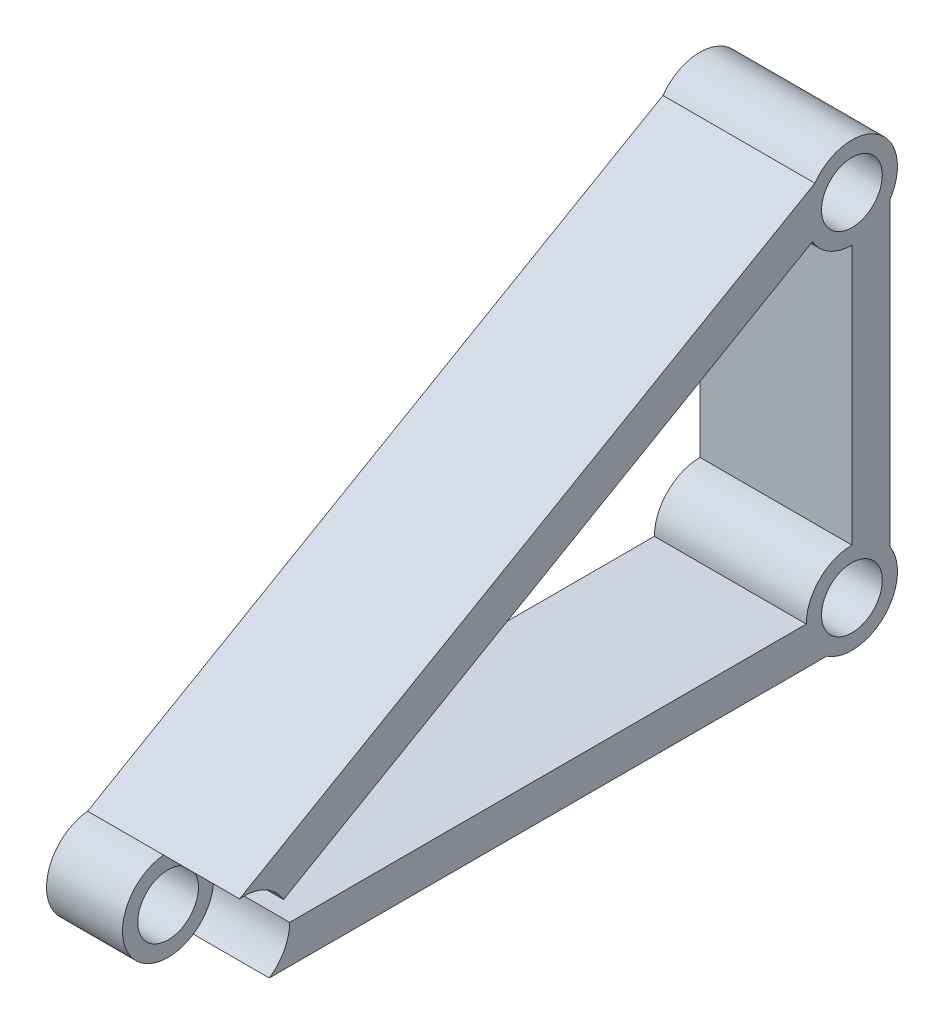
ISO-10303-21;
HEADER;
FILE_DESCRIPTION(('STEP AP214'),'2;1');
FILE_NAME('part.step','',(''),(''),'','','');
FILE_SCHEMA(('AUTOMOTIVE_DESIGN { 1 0 10303 214 1 1 1 1 }'));
ENDSEC;
DATA;
#1=APPLICATION_CONTEXT('core data for automotive mechanical design processes');
#2=APPLICATION_PROTOCOL_DEFINITION('international standard','automotive_design',2000,#1);
#3=PRODUCT_CONTEXT('',#1,'mechanical');
#4=PRODUCT('Part','Part','',(#3));
#5=PRODUCT_RELATED_PRODUCT_CATEGORY('part','',(#4));
#6=PRODUCT_DEFINITION_FORMATION('','',#4);
#7=PRODUCT_DEFINITION_CONTEXT('part definition',#1,'design');
#8=PRODUCT_DEFINITION('design','',#6,#7);
#9=PRODUCT_DEFINITION_SHAPE('','',#8);
#10=(LENGTH_UNIT() NAMED_UNIT(*) SI_UNIT(.MILLI.,.METRE.));
#11=(NAMED_UNIT(*) PLANE_ANGLE_UNIT() SI_UNIT($,.RADIAN.));
#12=(NAMED_UNIT(*) SI_UNIT($,.STERADIAN.) SOLID_ANGLE_UNIT());
#13=UNCERTAINTY_MEASURE_WITH_UNIT(LENGTH_MEASURE(1.E-05),#10,'distance_accuracy_value','');
#14=(GEOMETRIC_REPRESENTATION_CONTEXT(3) GLOBAL_UNCERTAINTY_ASSIGNED_CONTEXT((#13)) GLOBAL_UNIT_ASSIGNED_CONTEXT((#10,
#11,#12)) REPRESENTATION_CONTEXT('',''));
#15=CARTESIAN_POINT('',(0.,0.,0.));
#16=DIRECTION('',(0.,0.,1.));
#17=DIRECTION('',(1.,0.,0.));
#18=AXIS2_PLACEMENT_3D('',#15,#16,#17);
#19=CARTESIAN_POINT('',(200.,117.272238992097,-728.695495681406));
#20=DIRECTION('',(-1.,0.,0.));
#21=DIRECTION('',(0.,0.,1.));
#22=AXIS2_PLACEMENT_3D('',#19,#20,#21);
#23=CYLINDRICAL_SURFACE('',#22,60.);
#24=CARTESIAN_POINT('',(100.,117.272238992097,-728.695495681406));
#25=DIRECTION('',(1.,0.,0.));
#26=DIRECTION('',(0.,0.,-1.));
#27=AXIS2_PLACEMENT_3D('',#24,#25,#26);
#28=CIRCLE('',#27,60.0000000000001);
#29=CARTESIAN_POINT('',(100.,176.977096532432,-722.751592410974));
#30=VERTEX_POINT('',#29);
#31=CARTESIAN_POINT('',(100.,67.2722389920925,-761.861743584954));
#32=VERTEX_POINT('',#31);
#33=EDGE_CURVE('E292',#30,#32,#28,.T.);
#34=ORIENTED_EDGE('',*,*,#33,.F.);
#35=DIRECTION('',(-1.,0.,0.));
#36=VECTOR('',#35,1.);
#37=CARTESIAN_POINT('',(200.,176.977096532432,-722.751592410974));
#38=LINE('',#37,#36);
#39=CARTESIAN_POINT('',(0.,176.977096532432,-722.751592410974));
#40=VERTEX_POINT('',#39);
#41=EDGE_CURVE('E109',#30,#40,#38,.T.);
#42=ORIENTED_EDGE('',*,*,#41,.T.);
#43=CARTESIAN_POINT('',(0.,117.272238992097,-728.695495681406));
#44=DIRECTION('',(1.,0.,0.));
#45=DIRECTION('',(0.,0.,-1.));
#46=AXIS2_PLACEMENT_3D('',#43,#44,#45);
#47=CIRCLE('',#46,60.);
#48=CARTESIAN_POINT('',(0.,67.2722389920924,-761.861743584953));
#49=VERTEX_POINT('',#48);
#50=EDGE_CURVE('E184',#40,#49,#47,.T.);
#51=ORIENTED_EDGE('',*,*,#50,.T.);
#52=DIRECTION('',(-1.,0.,0.));
#53=VECTOR('',#52,1.);
#54=CARTESIAN_POINT('',(200.,67.2722389920924,-761.861743584953));
#55=LINE('',#54,#53);
#56=EDGE_CURVE('E220',#32,#49,#55,.T.);
#57=ORIENTED_EDGE('',*,*,#56,.F.);
#58=EDGE_LOOP('',(#34,#42,#51,#57));
#59=FACE_BOUND('',#58,.T.);
#60=ADVANCED_FACE('F41',(#59),#23,.T.);
#61=CARTESIAN_POINT('',(100.,117.272238992097,-788.695495681406));
#62=VERTEX_POINT('',#61);
#63=CARTESIAN_POINT('',(100.,147.272238992097,-780.657019908473));
#64=VERTEX_POINT('',#63);
#65=EDGE_CURVE('E266',#62,#64,#28,.T.);
#66=ORIENTED_EDGE('',*,*,#65,.F.);
#67=DIRECTION('',(-1.,0.,0.));
#68=VECTOR('',#67,1.);
#69=CARTESIAN_POINT('',(200.,117.272238992096,-788.695495681406));
#70=LINE('',#69,#68);
#71=CARTESIAN_POINT('',(0.,117.272238992096,-788.695495681406));
#72=VERTEX_POINT('',#71);
#73=EDGE_CURVE('E235',#62,#72,#70,.T.);
#74=ORIENTED_EDGE('',*,*,#73,.T.);
#75=CARTESIAN_POINT('',(0.,147.272238992096,-780.657019908473));
#76=VERTEX_POINT('',#75);
#77=EDGE_CURVE('E180',#72,#76,#47,.T.);
#78=ORIENTED_EDGE('',*,*,#77,.T.);
#79=DIRECTION('',(-1.,0.,0.));
#80=VECTOR('',#79,1.);
#81=CARTESIAN_POINT('',(200.,147.272238992096,-780.657019908473));
#82=LINE('',#81,#80);
#83=EDGE_CURVE('E231',#64,#76,#82,.T.);
#84=ORIENTED_EDGE('',*,*,#83,.F.);
#85=EDGE_LOOP('',(#66,#74,#78,#84));
#86=FACE_BOUND('',#85,.T.);
#87=ADVANCED_FACE('F263',(#86),#23,.T.);
#88=CARTESIAN_POINT('',(200.,117.272238992097,-728.695495681406));
#89=DIRECTION('',(-1.,0.,0.));
#90=DIRECTION('',(0.,0.,1.));
#91=AXIS2_PLACEMENT_3D('',#88,#89,#90);
#92=CYLINDRICAL_SURFACE('',#91,39.9999999999999);
#93=CARTESIAN_POINT('',(0.,117.272238992097,-728.695495681406));
#94=DIRECTION('',(1.,0.,0.));
#95=DIRECTION('',(0.,0.,-1.));
#96=AXIS2_PLACEMENT_3D('',#93,#94,#95);
#97=CIRCLE('',#96,39.9999999999999);
#98=CARTESIAN_POINT('',(0.,117.272238992097,-768.695495681406));
#99=VERTEX_POINT('',#98);
#100=EDGE_CURVE('E210',#99,#99,#97,.T.);
#101=ORIENTED_EDGE('',*,*,#100,.F.);
#102=EDGE_LOOP('',(#101));
#103=FACE_BOUND('',#102,.T.);
#104=CARTESIAN_POINT('',(100.,117.272238992097,-728.695495681406));
#105=DIRECTION('',(1.,0.,0.));
#106=DIRECTION('',(0.,0.,-1.));
#107=AXIS2_PLACEMENT_3D('',#104,#105,#106);
#108=CIRCLE('',#107,39.9999999999999);
#109=CARTESIAN_POINT('',(100.,117.272238992097,-768.695495681406));
#110=VERTEX_POINT('',#109);
#111=EDGE_CURVE('E45',#110,#110,#108,.T.);
#112=ORIENTED_EDGE('',*,*,#111,.T.);
#113=EDGE_LOOP('',(#112));
#114=FACE_BOUND('',#113,.T.);
#115=ADVANCED_FACE('F317',(#103,#114),#92,.F.);
#116=CARTESIAN_POINT('',(200.,67.2722389920925,0.));
#117=DIRECTION('',(0.,1.,0.));
#118=DIRECTION('',(0.,0.,1.));
#119=AXIS2_PLACEMENT_3D('',#116,#117,#118);
#120=PLANE('',#119);
#121=DIRECTION('',(0.,0.,-1.));
#122=VECTOR('',#121,1.);
#123=CARTESIAN_POINT('',(0.,67.2722389920925,0.));
#124=LINE('',#123,#122);
#125=CARTESIAN_POINT('',(0.,67.2722389920923,-1495.52924777785));
#126=VERTEX_POINT('',#125);
#127=EDGE_CURVE('E196',#49,#126,#124,.T.);
#128=ORIENTED_EDGE('',*,*,#127,.T.);
#129=DIRECTION('',(-1.,0.,0.));
#130=VECTOR('',#129,1.);
#131=CARTESIAN_POINT('',(200.,67.2722389920923,-1495.52924777785));
#132=LINE('',#131,#130);
#133=CARTESIAN_POINT('',(200.,67.2722389920923,-1495.52924777785));
#134=VERTEX_POINT('',#133);
#135=EDGE_CURVE('E149',#134,#126,#132,.T.);
#136=ORIENTED_EDGE('',*,*,#135,.F.);
#137=DIRECTION('',(0.,0.,-1.));
#138=VECTOR('',#137,1.);
#139=CARTESIAN_POINT('',(200.,67.2722389920925,0.));
#140=LINE('',#139,#138);
#141=CARTESIAN_POINT('',(200.,67.2722389920924,-761.861743584953));
#142=VERTEX_POINT('',#141);
#143=EDGE_CURVE('E158',#142,#134,#140,.T.);
#144=ORIENTED_EDGE('',*,*,#143,.F.);
#145=EDGE_CURVE('E221',#142,#32,#55,.T.);
#146=ORIENTED_EDGE('',*,*,#145,.T.);
#147=ORIENTED_EDGE('',*,*,#56,.T.);
#148=EDGE_LOOP('',(#128,#136,#144,#146,#147));
#149=FACE_BOUND('',#148,.T.);
#150=ADVANCED_FACE('F294',(#149),#120,.F.);
#151=CARTESIAN_POINT('',(200.,117.272238992091,-1528.69549568141));
#152=DIRECTION('',(-1.,0.,0.));
#153=DIRECTION('',(0.,0.,1.));
#154=AXIS2_PLACEMENT_3D('',#151,#152,#153);
#155=CYLINDRICAL_SURFACE('',#154,60.0000000000003);
#156=CARTESIAN_POINT('',(0.,117.272238992091,-1528.69549568141));
#157=DIRECTION('',(1.,0.,0.));
#158=DIRECTION('',(0.,0.,-1.));
#159=AXIS2_PLACEMENT_3D('',#156,#157,#158);
#160=CIRCLE('',#159,60.0000000000003);
#161=CARTESIAN_POINT('',(0.,150.438486895645,-1578.69549568141));
#162=VERTEX_POINT('',#161);
#163=EDGE_CURVE('E144',#162,#126,#160,.F.);
#164=ORIENTED_EDGE('',*,*,#163,.F.);
#165=DIRECTION('',(-1.,0.,0.));
#166=VECTOR('',#165,1.);
#167=CARTESIAN_POINT('',(200.,150.438486895645,-1578.69549568141));
#168=LINE('',#167,#166);
#169=CARTESIAN_POINT('',(200.,150.438486895645,-1578.69549568141));
#170=VERTEX_POINT('',#169);
#171=EDGE_CURVE('E139',#170,#162,#168,.T.);
#172=ORIENTED_EDGE('',*,*,#171,.F.);
#173=CARTESIAN_POINT('',(200.,117.272238992091,-1528.69549568141));
#174=DIRECTION('',(1.,0.,0.));
#175=DIRECTION('',(0.,0.,-1.));
#176=AXIS2_PLACEMENT_3D('',#173,#174,#175);
#177=CIRCLE('',#176,60.0000000000003);
#178=EDGE_CURVE('E142',#170,#134,#177,.F.);
#179=ORIENTED_EDGE('',*,*,#178,.T.);
#180=ORIENTED_EDGE('',*,*,#135,.T.);
#181=EDGE_LOOP('',(#164,#172,#179,#180));
#182=FACE_BOUND('',#181,.T.);
#183=ADVANCED_FACE('F141',(#182),#155,.T.);
#184=CARTESIAN_POINT('',(200.,0.,-1578.69549568141));
#185=DIRECTION('',(0.,0.,-1.));
#186=DIRECTION('',(-1.,0.,0.));
#187=AXIS2_PLACEMENT_3D('',#184,#185,#186);
#188=PLANE('',#187);
#189=DIRECTION('',(0.,-1.,0.));
#190=VECTOR('',#189,1.);
#191=CARTESIAN_POINT('',(0.,0.,-1578.69549568141));
#192=LINE('',#191,#190);
#193=CARTESIAN_POINT('',(0.,545.986206440239,-1578.69549568141));
#194=VERTEX_POINT('',#193);
#195=EDGE_CURVE('E199',#194,#162,#192,.T.);
#196=ORIENTED_EDGE('',*,*,#195,.F.);
#197=DIRECTION('',(-1.,0.,0.));
#198=VECTOR('',#197,1.);
#199=CARTESIAN_POINT('',(200.,545.986206440239,-1578.69549568141));
#200=LINE('',#199,#198);
#201=CARTESIAN_POINT('',(200.,545.986206440239,-1578.69549568141));
#202=VERTEX_POINT('',#201);
#203=EDGE_CURVE('E150',#202,#194,#200,.T.);
#204=ORIENTED_EDGE('',*,*,#203,.F.);
#205=DIRECTION('',(0.,-1.,0.));
#206=VECTOR('',#205,1.);
#207=CARTESIAN_POINT('',(200.,0.,-1578.69549568141));
#208=LINE('',#207,#206);
#209=EDGE_CURVE('E155',#202,#170,#208,.T.);
#210=ORIENTED_EDGE('',*,*,#209,.T.);
#211=ORIENTED_EDGE('',*,*,#171,.T.);
#212=EDGE_LOOP('',(#196,#204,#210,#211));
#213=FACE_BOUND('',#212,.T.);
#214=ADVANCED_FACE('F162',(#213),#188,.T.);
#215=CARTESIAN_POINT('',(200.,579.152454343792,-1528.69549568141));
#216=DIRECTION('',(-1.,0.,0.));
#217=DIRECTION('',(0.,0.,1.));
#218=AXIS2_PLACEMENT_3D('',#215,#216,#217);
#219=CYLINDRICAL_SURFACE('',#218,60.);
#220=CARTESIAN_POINT('',(0.,579.152454343792,-1528.69549568141));
#221=DIRECTION('',(1.,0.,0.));
#222=DIRECTION('',(0.,0.,-1.));
#223=AXIS2_PLACEMENT_3D('',#220,#221,#222);
#224=CIRCLE('',#223,60.);
#225=CARTESIAN_POINT('',(0.,614.152454343792,-1479.96152395736));
#226=VERTEX_POINT('',#225);
#227=EDGE_CURVE('E190',#194,#226,#224,.T.);
#228=ORIENTED_EDGE('',*,*,#227,.T.);
#229=DIRECTION('',(-1.,0.,0.));
#230=VECTOR('',#229,1.);
#231=CARTESIAN_POINT('',(200.,614.152454343792,-1479.96152395736));
#232=LINE('',#231,#230);
#233=CARTESIAN_POINT('',(200.,614.152454343792,-1479.96152395736));
#234=VERTEX_POINT('',#233);
#235=EDGE_CURVE('E101',#234,#226,#232,.T.);
#236=ORIENTED_EDGE('',*,*,#235,.F.);
#237=CARTESIAN_POINT('',(200.,579.152454343792,-1528.69549568141));
#238=DIRECTION('',(1.,0.,0.));
#239=DIRECTION('',(0.,0.,-1.));
#240=AXIS2_PLACEMENT_3D('',#237,#238,#239);
#241=CIRCLE('',#240,60.);
#242=EDGE_CURVE('E59',#202,#234,#241,.T.);
#243=ORIENTED_EDGE('',*,*,#242,.F.);
#244=ORIENTED_EDGE('',*,*,#203,.T.);
#245=EDGE_LOOP('',(#228,#236,#243,#244));
#246=FACE_BOUND('',#245,.T.);
#247=ADVANCED_FACE('F333',(#246),#219,.T.);
#248=CARTESIAN_POINT('',(200.,117.272238992103,-9.14260401351833E-13));
#249=DIRECTION('',(0.,-1.,0.));
#250=DIRECTION('',(0.,0.,-1.));
#251=AXIS2_PLACEMENT_3D('',#248,#249,#250);
#252=PLANE('',#251);
#253=DIRECTION('',(0.,0.,1.));
#254=VECTOR('',#253,1.);
#255=CARTESIAN_POINT('',(0.,117.272238992103,-9.14260401351833E-13));
#256=LINE('',#255,#254);
#257=CARTESIAN_POINT('',(0.,117.272238992091,-1468.69549568141));
#258=VERTEX_POINT('',#257);
#259=EDGE_CURVE('E177',#258,#72,#256,.T.);
#260=ORIENTED_EDGE('',*,*,#259,.T.);
#261=ORIENTED_EDGE('',*,*,#73,.F.);
#262=CARTESIAN_POINT('',(200.,117.272238992097,-788.695495681406));
#263=VERTEX_POINT('',#262);
#264=EDGE_CURVE('E236',#263,#62,#70,.T.);
#265=ORIENTED_EDGE('',*,*,#264,.F.);
#266=DIRECTION('',(0.,0.,1.));
#267=VECTOR('',#266,1.);
#268=CARTESIAN_POINT('',(200.,117.272238992103,-9.14260401351833E-13));
#269=LINE('',#268,#267);
#270=CARTESIAN_POINT('',(200.,117.272238992091,-1468.69549568141));
#271=VERTEX_POINT('',#270);
#272=EDGE_CURVE('E213',#271,#263,#269,.T.);
#273=ORIENTED_EDGE('',*,*,#272,.F.);
#274=DIRECTION('',(-1.,0.,0.));
#275=VECTOR('',#274,1.);
#276=CARTESIAN_POINT('',(200.,117.272238992091,-1468.69549568141));
#277=LINE('',#276,#275);
#278=EDGE_CURVE('E176',#271,#258,#277,.T.);
#279=ORIENTED_EDGE('',*,*,#278,.T.);
#280=EDGE_LOOP('',(#260,#261,#265,#273,#279));
#281=FACE_BOUND('',#280,.T.);
#282=ADVANCED_FACE('F43',(#281),#252,.F.);
#283=CARTESIAN_POINT('',(200.,-227.58022619762,-131.39350485743));
#284=DIRECTION('',(0.,-0.866025403784442,-0.499999999999995));
#285=DIRECTION('',(0.,0.499999999999995,-0.866025403784441));
#286=AXIS2_PLACEMENT_3D('',#283,#284,#285);
#287=PLANE('',#286);
#288=DIRECTION('',(0.,-0.499999999999995,0.866025403784442));
#289=VECTOR('',#288,1.);
#290=CARTESIAN_POINT('',(0.,-227.58022619762,-131.39350485743));
#291=LINE('',#290,#289);
#292=CARTESIAN_POINT('',(0.,549.152454343791,-1476.73397145434));
#293=VERTEX_POINT('',#292);
#294=EDGE_CURVE('E183',#293,#76,#291,.T.);
#295=ORIENTED_EDGE('',*,*,#294,.F.);
#296=DIRECTION('',(-1.,0.,0.));
#297=VECTOR('',#296,1.);
#298=CARTESIAN_POINT('',(200.,549.152454343791,-1476.73397145434));
#299=LINE('',#298,#297);
#300=CARTESIAN_POINT('',(200.,549.152454343791,-1476.73397145434));
#301=VERTEX_POINT('',#300);
#302=EDGE_CURVE('E117',#301,#293,#299,.T.);
#303=ORIENTED_EDGE('',*,*,#302,.F.);
#304=DIRECTION('',(0.,-0.499999999999995,0.866025403784442));
#305=VECTOR('',#304,1.);
#306=CARTESIAN_POINT('',(200.,-227.58022619762,-131.39350485743));
#307=LINE('',#306,#305);
#308=CARTESIAN_POINT('',(200.,147.272238992097,-780.657019908473));
#309=VERTEX_POINT('',#308);
#310=EDGE_CURVE('E254',#301,#309,#307,.T.);
#311=ORIENTED_EDGE('',*,*,#310,.T.);
#312=EDGE_CURVE('E232',#309,#64,#82,.T.);
#313=ORIENTED_EDGE('',*,*,#312,.T.);
#314=ORIENTED_EDGE('',*,*,#83,.T.);
#315=EDGE_LOOP('',(#295,#303,#311,#313,#314));
#316=FACE_BOUND('',#315,.T.);
#317=ADVANCED_FACE('F273',(#316),#287,.T.);
#318=CARTESIAN_POINT('',(0.,519.152454343792,-1528.69549568141));
#319=VERTEX_POINT('',#318);
#320=EDGE_CURVE('E187',#293,#319,#224,.T.);
#321=ORIENTED_EDGE('',*,*,#320,.T.);
#322=DIRECTION('',(-1.,0.,0.));
#323=VECTOR('',#322,1.);
#324=CARTESIAN_POINT('',(200.,519.152454343792,-1528.69549568141));
#325=LINE('',#324,#323);
#326=CARTESIAN_POINT('',(200.,519.152454343792,-1528.69549568141));
#327=VERTEX_POINT('',#326);
#328=EDGE_CURVE('E227',#327,#319,#325,.T.);
#329=ORIENTED_EDGE('',*,*,#328,.F.);
#330=EDGE_CURVE('E166',#301,#327,#241,.T.);
#331=ORIENTED_EDGE('',*,*,#330,.F.);
#332=ORIENTED_EDGE('',*,*,#302,.T.);
#333=EDGE_LOOP('',(#321,#329,#331,#332));
#334=FACE_BOUND('',#333,.T.);
#335=ADVANCED_FACE('F324',(#334),#219,.T.);
#336=CARTESIAN_POINT('',(200.,9.92858235566701E-13,-1528.69549568141));
#337=DIRECTION('',(0.,0.,-1.));
#338=DIRECTION('',(0.,1.,0.));
#339=AXIS2_PLACEMENT_3D('',#336,#337,#338);
#340=PLANE('',#339);
#341=DIRECTION('',(0.,-1.,0.));
#342=VECTOR('',#341,1.);
#343=CARTESIAN_POINT('',(0.,9.92858235566701E-13,-1528.69549568141));
#344=LINE('',#343,#342);
#345=CARTESIAN_POINT('',(0.,177.272238992091,-1528.69549568141));
#346=VERTEX_POINT('',#345);
#347=EDGE_CURVE('E189',#319,#346,#344,.T.);
#348=ORIENTED_EDGE('',*,*,#347,.T.);
#349=DIRECTION('',(-1.,0.,0.));
#350=VECTOR('',#349,1.);
#351=CARTESIAN_POINT('',(200.,177.272238992091,-1528.69549568141));
#352=LINE('',#351,#350);
#353=CARTESIAN_POINT('',(200.,177.272238992091,-1528.69549568141));
#354=VERTEX_POINT('',#353);
#355=EDGE_CURVE('E225',#354,#346,#352,.T.);
#356=ORIENTED_EDGE('',*,*,#355,.F.);
#357=DIRECTION('',(0.,-1.,0.));
#358=VECTOR('',#357,1.);
#359=CARTESIAN_POINT('',(200.,9.92858235566701E-13,-1528.69549568141));
#360=LINE('',#359,#358);
#361=EDGE_CURVE('E295',#327,#354,#360,.T.);
#362=ORIENTED_EDGE('',*,*,#361,.F.);
#363=ORIENTED_EDGE('',*,*,#328,.T.);
#364=EDGE_LOOP('',(#348,#356,#362,#363));
#365=FACE_BOUND('',#364,.T.);
#366=ADVANCED_FACE('F321',(#365),#340,.F.);
#367=CARTESIAN_POINT('',(200.,117.272238992091,-1528.69549568141));
#368=DIRECTION('',(-1.,0.,0.));
#369=DIRECTION('',(0.,0.,1.));
#370=AXIS2_PLACEMENT_3D('',#367,#368,#369);
#371=CYLINDRICAL_SURFACE('',#370,40.0000000000002);
#372=CARTESIAN_POINT('',(200.,117.272238992091,-1528.69549568141));
#373=DIRECTION('',(1.,0.,0.));
#374=DIRECTION('',(0.,0.,-1.));
#375=AXIS2_PLACEMENT_3D('',#372,#373,#374);
#376=CIRCLE('',#375,40.0000000000002);
#377=CARTESIAN_POINT('',(200.,117.272238992091,-1568.69549568141));
#378=VERTEX_POINT('',#377);
#379=EDGE_CURVE('E173',#378,#378,#376,.T.);
#380=ORIENTED_EDGE('',*,*,#379,.T.);
#381=EDGE_LOOP('',(#380));
#382=FACE_BOUND('',#381,.T.);
#383=CARTESIAN_POINT('',(0.,117.272238992091,-1528.69549568141));
#384=DIRECTION('',(1.,0.,0.));
#385=DIRECTION('',(0.,0.,-1.));
#386=AXIS2_PLACEMENT_3D('',#383,#384,#385);
#387=CIRCLE('',#386,40.0000000000002);
#388=CARTESIAN_POINT('',(0.,117.272238992091,-1568.69549568141));
#389=VERTEX_POINT('',#388);
#390=EDGE_CURVE('E207',#389,#389,#387,.T.);
#391=ORIENTED_EDGE('',*,*,#390,.F.);
#392=EDGE_LOOP('',(#391));
#393=FACE_BOUND('',#392,.T.);
#394=ADVANCED_FACE('F323',(#382,#393),#371,.F.);
#395=CARTESIAN_POINT('',(200.,579.152454343792,-1528.69549568141));
#396=DIRECTION('',(-1.,0.,0.));
#397=DIRECTION('',(0.,0.,1.));
#398=AXIS2_PLACEMENT_3D('',#395,#396,#397);
#399=CYLINDRICAL_SURFACE('',#398,40.0000000000001);
#400=CARTESIAN_POINT('',(200.,579.152454343792,-1528.69549568141));
#401=DIRECTION('',(1.,0.,0.));
#402=DIRECTION('',(0.,0.,-1.));
#403=AXIS2_PLACEMENT_3D('',#400,#401,#402);
#404=CIRCLE('',#403,40.0000000000001);
#405=CARTESIAN_POINT('',(200.,579.152454343792,-1568.69549568141));
#406=VERTEX_POINT('',#405);
#407=EDGE_CURVE('E170',#406,#406,#404,.T.);
#408=ORIENTED_EDGE('',*,*,#407,.T.);
#409=EDGE_LOOP('',(#408));
#410=FACE_BOUND('',#409,.T.);
#411=CARTESIAN_POINT('',(0.,579.152454343792,-1528.69549568141));
#412=DIRECTION('',(1.,0.,0.));
#413=DIRECTION('',(0.,0.,-1.));
#414=AXIS2_PLACEMENT_3D('',#411,#412,#413);
#415=CIRCLE('',#414,40.0000000000001);
#416=CARTESIAN_POINT('',(0.,579.152454343792,-1568.69549568141));
#417=VERTEX_POINT('',#416);
#418=EDGE_CURVE('E204',#417,#417,#415,.T.);
#419=ORIENTED_EDGE('',*,*,#418,.F.);
#420=EDGE_LOOP('',(#419));
#421=FACE_BOUND('',#420,.T.);
#422=ADVANCED_FACE('F355',(#410,#421),#399,.F.);
#423=CARTESIAN_POINT('',(200.,-180.227797427453,-104.054567360192));
#424=DIRECTION('',(0.,0.866025403784441,0.499999999999995));
#425=DIRECTION('',(0.,-0.499999999999995,0.866025403784441));
#426=AXIS2_PLACEMENT_3D('',#423,#424,#425);
#427=PLANE('',#426);
#428=DIRECTION('',(0.,0.499999999999995,-0.866025403784441));
#429=VECTOR('',#428,1.);
#430=CARTESIAN_POINT('',(0.,-180.227797427453,-104.054567360192));
#431=LINE('',#430,#429);
#432=EDGE_CURVE('E201',#40,#226,#431,.T.);
#433=ORIENTED_EDGE('',*,*,#432,.F.);
#434=ORIENTED_EDGE('',*,*,#41,.F.);
#435=CARTESIAN_POINT('',(200.,176.977096532432,-722.751592410974));
#436=VERTEX_POINT('',#435);
#437=EDGE_CURVE('E214',#436,#30,#38,.T.);
#438=ORIENTED_EDGE('',*,*,#437,.F.);
#439=DIRECTION('',(0.,0.499999999999995,-0.866025403784441));
#440=VECTOR('',#439,1.);
#441=CARTESIAN_POINT('',(200.,-180.227797427453,-104.054567360192));
#442=LINE('',#441,#440);
#443=EDGE_CURVE('E164',#436,#234,#442,.T.);
#444=ORIENTED_EDGE('',*,*,#443,.T.);
#445=ORIENTED_EDGE('',*,*,#235,.T.);
#446=EDGE_LOOP('',(#433,#434,#438,#444,#445));
#447=FACE_BOUND('',#446,.T.);
#448=ADVANCED_FACE('F286',(#447),#427,.T.);
#449=EDGE_CURVE('E193',#258,#346,#160,.F.);
#450=ORIENTED_EDGE('',*,*,#449,.F.);
#451=ORIENTED_EDGE('',*,*,#278,.F.);
#452=EDGE_CURVE('E161',#271,#354,#177,.F.);
#453=ORIENTED_EDGE('',*,*,#452,.T.);
#454=ORIENTED_EDGE('',*,*,#355,.T.);
#455=EDGE_LOOP('',(#450,#451,#453,#454));
#456=FACE_BOUND('',#455,.T.);
#457=ADVANCED_FACE('F345',(#456),#155,.T.);
#458=CARTESIAN_POINT('',(200.,0.,0.));
#459=DIRECTION('',(1.,0.,0.));
#460=DIRECTION('',(0.,0.,-1.));
#461=AXIS2_PLACEMENT_3D('',#458,#459,#460);
#462=PLANE('',#461);
#463=CARTESIAN_POINT('',(200.,117.272238992097,-728.695495681406));
#464=DIRECTION('',(1.,0.,0.));
#465=DIRECTION('',(0.,0.,-1.));
#466=AXIS2_PLACEMENT_3D('',#463,#464,#465);
#467=CIRCLE('',#466,60.0000000000001);
#468=EDGE_CURVE('E11',#309,#436,#467,.T.);
#469=ORIENTED_EDGE('',*,*,#468,.F.);
#470=ORIENTED_EDGE('',*,*,#310,.F.);
#471=ORIENTED_EDGE('',*,*,#330,.T.);
#472=ORIENTED_EDGE('',*,*,#361,.T.);
#473=ORIENTED_EDGE('',*,*,#452,.F.);
#474=ORIENTED_EDGE('',*,*,#272,.T.);
#475=EDGE_CURVE('E51',#142,#263,#467,.T.);
#476=ORIENTED_EDGE('',*,*,#475,.F.);
#477=ORIENTED_EDGE('',*,*,#143,.T.);
#478=ORIENTED_EDGE('',*,*,#178,.F.);
#479=ORIENTED_EDGE('',*,*,#209,.F.);
#480=ORIENTED_EDGE('',*,*,#242,.T.);
#481=ORIENTED_EDGE('',*,*,#443,.F.);
#482=EDGE_LOOP('',(#469,#470,#471,#472,#473,#474,#476,#477,#478,#479,#480,#481));
#483=FACE_BOUND('',#482,.T.);
#484=ORIENTED_EDGE('',*,*,#407,.F.);
#485=EDGE_LOOP('',(#484));
#486=FACE_BOUND('',#485,.T.);
#487=ORIENTED_EDGE('',*,*,#379,.F.);
#488=EDGE_LOOP('',(#487));
#489=FACE_BOUND('',#488,.T.);
#490=ADVANCED_FACE('F153',(#483,#486,#489),#462,.T.);
#491=CARTESIAN_POINT('',(0.,0.,0.));
#492=DIRECTION('',(1.,0.,0.));
#493=DIRECTION('',(0.,0.,-1.));
#494=AXIS2_PLACEMENT_3D('',#491,#492,#493);
#495=PLANE('',#494);
#496=ORIENTED_EDGE('',*,*,#259,.F.);
#497=ORIENTED_EDGE('',*,*,#449,.T.);
#498=ORIENTED_EDGE('',*,*,#347,.F.);
#499=ORIENTED_EDGE('',*,*,#320,.F.);
#500=ORIENTED_EDGE('',*,*,#294,.T.);
#501=ORIENTED_EDGE('',*,*,#77,.F.);
#502=EDGE_LOOP('',(#496,#497,#498,#499,#500,#501));
#503=FACE_BOUND('',#502,.T.);
#504=ORIENTED_EDGE('',*,*,#50,.F.);
#505=ORIENTED_EDGE('',*,*,#432,.T.);
#506=ORIENTED_EDGE('',*,*,#227,.F.);
#507=ORIENTED_EDGE('',*,*,#195,.T.);
#508=ORIENTED_EDGE('',*,*,#163,.T.);
#509=ORIENTED_EDGE('',*,*,#127,.F.);
#510=EDGE_LOOP('',(#504,#505,#506,#507,#508,#509));
#511=FACE_BOUND('',#510,.T.);
#512=ORIENTED_EDGE('',*,*,#418,.T.);
#513=EDGE_LOOP('',(#512));
#514=FACE_BOUND('',#513,.T.);
#515=ORIENTED_EDGE('',*,*,#390,.T.);
#516=EDGE_LOOP('',(#515));
#517=FACE_BOUND('',#516,.T.);
#518=ORIENTED_EDGE('',*,*,#100,.T.);
#519=EDGE_LOOP('',(#518));
#520=FACE_BOUND('',#519,.T.);
#521=ADVANCED_FACE('F268',(#503,#511,#514,#517,#520),#495,.F.);
#522=CARTESIAN_POINT('',(100.,117.272238992097,-728.695495681406));
#523=DIRECTION('',(1.,0.,0.));
#524=DIRECTION('',(0.,0.,-1.));
#525=AXIS2_PLACEMENT_3D('',#522,#523,#524);
#526=CYLINDRICAL_SURFACE('',#525,60.0000000000001);
#527=ORIENTED_EDGE('',*,*,#475,.T.);
#528=ORIENTED_EDGE('',*,*,#264,.T.);
#529=EDGE_CURVE('E300',#32,#62,#28,.T.);
#530=ORIENTED_EDGE('',*,*,#529,.F.);
#531=ORIENTED_EDGE('',*,*,#145,.F.);
#532=EDGE_LOOP('',(#527,#528,#530,#531));
#533=FACE_BOUND('',#532,.T.);
#534=ADVANCED_FACE('F242',(#533),#526,.F.);
#535=ORIENTED_EDGE('',*,*,#312,.F.);
#536=ORIENTED_EDGE('',*,*,#468,.T.);
#537=ORIENTED_EDGE('',*,*,#437,.T.);
#538=EDGE_CURVE('E280',#64,#30,#28,.T.);
#539=ORIENTED_EDGE('',*,*,#538,.F.);
#540=EDGE_LOOP('',(#535,#536,#537,#539));
#541=FACE_BOUND('',#540,.T.);
#542=ADVANCED_FACE('F284',(#541),#526,.F.);
#543=CARTESIAN_POINT('',(100.,117.272238992097,-728.695495681406));
#544=DIRECTION('',(1.,0.,0.));
#545=DIRECTION('',(0.,0.,-1.));
#546=AXIS2_PLACEMENT_3D('',#543,#544,#545);
#547=PLANE('',#546);
#548=ORIENTED_EDGE('',*,*,#111,.F.);
#549=EDGE_LOOP('',(#548));
#550=FACE_BOUND('',#549,.T.);
#551=ORIENTED_EDGE('',*,*,#65,.T.);
#552=ORIENTED_EDGE('',*,*,#538,.T.);
#553=ORIENTED_EDGE('',*,*,#33,.T.);
#554=ORIENTED_EDGE('',*,*,#529,.T.);
#555=EDGE_LOOP('',(#551,#552,#553,#554));
#556=FACE_BOUND('',#555,.T.);
#557=ADVANCED_FACE('F303',(#550,#556),#547,.T.);
#558=CLOSED_SHELL('',(#60,#87,#115,#150,#183,#214,#247,#282,#317,#335,#366,#394,#422,#448,#457,
#490,#521,#534,#542,#557));
#559=MANIFOLD_SOLID_BREP('B2',#558);
#560=ADVANCED_BREP_SHAPE_REPRESENTATION('',(#18,#559),#14);
#561=SHAPE_DEFINITION_REPRESENTATION(#9,#560);
ENDSEC;
END-ISO-10303-21;
